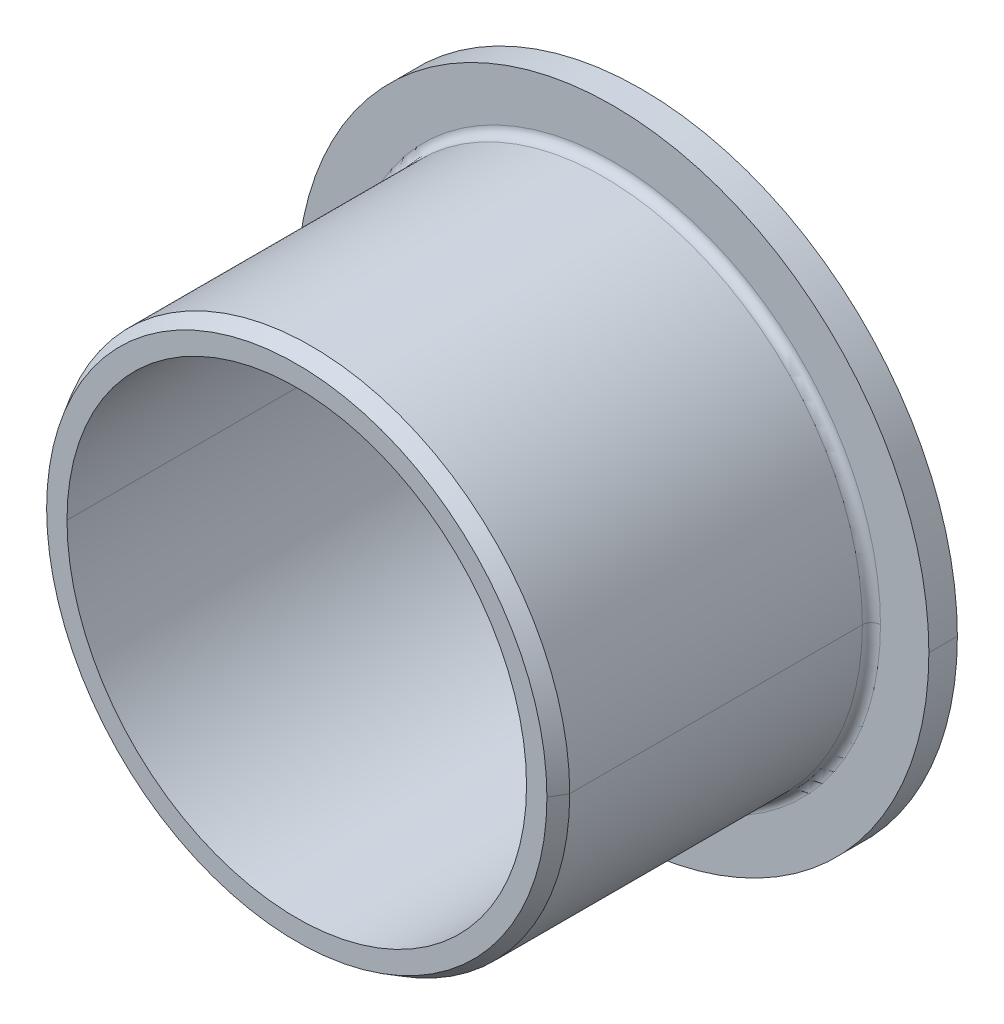
ISO-10303-21;
HEADER;
FILE_DESCRIPTION(('STEP AP214'),'2;1');
FILE_NAME('part.step','',(''),(''),'','','');
FILE_SCHEMA(('AUTOMOTIVE_DESIGN { 1 0 10303 214 1 1 1 1 }'));
ENDSEC;
DATA;
#1=APPLICATION_CONTEXT('core data for automotive mechanical design processes');
#2=APPLICATION_PROTOCOL_DEFINITION('international standard','automotive_design',2000,#1);
#3=PRODUCT_CONTEXT('',#1,'mechanical');
#4=PRODUCT('Part','Part','',(#3));
#5=PRODUCT_RELATED_PRODUCT_CATEGORY('part','',(#4));
#6=PRODUCT_DEFINITION_FORMATION('','',#4);
#7=PRODUCT_DEFINITION_CONTEXT('part definition',#1,'design');
#8=PRODUCT_DEFINITION('design','',#6,#7);
#9=PRODUCT_DEFINITION_SHAPE('','',#8);
#10=(LENGTH_UNIT() NAMED_UNIT(*) SI_UNIT(.MILLI.,.METRE.));
#11=(NAMED_UNIT(*) PLANE_ANGLE_UNIT() SI_UNIT($,.RADIAN.));
#12=(NAMED_UNIT(*) SI_UNIT($,.STERADIAN.) SOLID_ANGLE_UNIT());
#13=UNCERTAINTY_MEASURE_WITH_UNIT(LENGTH_MEASURE(1.E-05),#10,'distance_accuracy_value','');
#14=(GEOMETRIC_REPRESENTATION_CONTEXT(3) GLOBAL_UNCERTAINTY_ASSIGNED_CONTEXT((#13)) GLOBAL_UNIT_ASSIGNED_CONTEXT((#10,
#11,#12)) REPRESENTATION_CONTEXT('',''));
#15=CARTESIAN_POINT('',(0.,0.,0.));
#16=DIRECTION('',(0.,0.,1.));
#17=DIRECTION('',(1.,0.,0.));
#18=AXIS2_PLACEMENT_3D('',#15,#16,#17);
#19=CARTESIAN_POINT('',(15.08125,0.,0.));
#20=DIRECTION('',(0.,0.,-1.));
#21=DIRECTION('',(0.,-1.,0.));
#22=AXIS2_PLACEMENT_3D('',#19,#20,#21);
#23=PLANE('',#22);
#24=CARTESIAN_POINT('',(0.,0.,0.));
#25=DIRECTION('',(0.,0.,1.));
#26=DIRECTION('',(1.,0.,0.));
#27=AXIS2_PLACEMENT_3D('',#24,#25,#26);
#28=CIRCLE('',#27,12.7);
#29=CARTESIAN_POINT('',(12.7,0.,0.));
#30=VERTEX_POINT('',#29);
#31=CARTESIAN_POINT('',(-12.7,0.,0.));
#32=VERTEX_POINT('',#31);
#33=EDGE_CURVE('E10',#30,#32,#28,.T.);
#34=ORIENTED_EDGE('',*,*,#33,.T.);
#35=CARTESIAN_POINT('',(0.,0.,0.));
#36=DIRECTION('',(0.,0.,1.));
#37=DIRECTION('',(1.,0.,0.));
#38=AXIS2_PLACEMENT_3D('',#35,#36,#37);
#39=CIRCLE('',#38,12.7);
#40=EDGE_CURVE('E162',#32,#30,#39,.T.);
#41=ORIENTED_EDGE('',*,*,#40,.T.);
#42=EDGE_LOOP('',(#34,#41));
#43=FACE_BOUND('',#42,.T.);
#44=CARTESIAN_POINT('',(0.,0.,0.));
#45=DIRECTION('',(0.,0.,1.));
#46=DIRECTION('',(1.,0.,0.));
#47=AXIS2_PLACEMENT_3D('',#44,#45,#46);
#48=CIRCLE('',#47,17.4625);
#49=CARTESIAN_POINT('',(17.4625,0.,0.));
#50=VERTEX_POINT('',#49);
#51=CARTESIAN_POINT('',(-17.4625,0.,0.));
#52=VERTEX_POINT('',#51);
#53=EDGE_CURVE('E164',#50,#52,#48,.T.);
#54=ORIENTED_EDGE('',*,*,#53,.F.);
#55=CARTESIAN_POINT('',(0.,0.,0.));
#56=DIRECTION('',(0.,0.,1.));
#57=DIRECTION('',(1.,0.,0.));
#58=AXIS2_PLACEMENT_3D('',#55,#56,#57);
#59=CIRCLE('',#58,17.4625);
#60=EDGE_CURVE('E98',#52,#50,#59,.T.);
#61=ORIENTED_EDGE('',*,*,#60,.F.);
#62=EDGE_LOOP('',(#54,#61));
#63=FACE_BOUND('',#62,.T.);
#64=ADVANCED_FACE('F16',(#43,#63),#23,.T.);
#65=CARTESIAN_POINT('',(0.,0.,9.525));
#66=DIRECTION('',(0.,0.,1.));
#67=DIRECTION('',(1.,0.,0.));
#68=AXIS2_PLACEMENT_3D('',#65,#66,#67);
#69=CYLINDRICAL_SURFACE('',#68,12.7);
#70=DIRECTION('',(0.,0.,1.));
#71=VECTOR('',#70,1.);
#72=CARTESIAN_POINT('',(12.7,0.,9.525));
#73=LINE('',#72,#71);
#74=CARTESIAN_POINT('',(12.7,0.,19.05));
#75=VERTEX_POINT('',#74);
#76=EDGE_CURVE('E20',#30,#75,#73,.T.);
#77=ORIENTED_EDGE('',*,*,#76,.T.);
#78=CARTESIAN_POINT('',(0.,0.,19.05));
#79=DIRECTION('',(0.,0.,1.));
#80=DIRECTION('',(1.,0.,0.));
#81=AXIS2_PLACEMENT_3D('',#78,#79,#80);
#82=CIRCLE('',#81,12.7);
#83=CARTESIAN_POINT('',(-12.7,0.,19.05));
#84=VERTEX_POINT('',#83);
#85=EDGE_CURVE('E27',#75,#84,#82,.T.);
#86=ORIENTED_EDGE('',*,*,#85,.T.);
#87=DIRECTION('',(0.,0.,-1.));
#88=VECTOR('',#87,1.);
#89=CARTESIAN_POINT('',(-12.7,0.,9.525));
#90=LINE('',#89,#88);
#91=EDGE_CURVE('E192',#84,#32,#90,.T.);
#92=ORIENTED_EDGE('',*,*,#91,.T.);
#93=ORIENTED_EDGE('',*,*,#33,.F.);
#94=EDGE_LOOP('',(#77,#86,#92,#93));
#95=FACE_BOUND('',#94,.T.);
#96=ADVANCED_FACE('F18',(#95),#69,.F.);
#97=CARTESIAN_POINT('',(13.2628098923,0.,19.05));
#98=DIRECTION('',(0.,0.,1.));
#99=DIRECTION('',(1.,0.,0.));
#100=AXIS2_PLACEMENT_3D('',#97,#98,#99);
#101=PLANE('',#100);
#102=ORIENTED_EDGE('',*,*,#85,.F.);
#103=CARTESIAN_POINT('',(0.,0.,19.05));
#104=DIRECTION('',(0.,0.,1.));
#105=DIRECTION('',(1.,0.,0.));
#106=AXIS2_PLACEMENT_3D('',#103,#104,#105);
#107=CIRCLE('',#106,12.7);
#108=EDGE_CURVE('E189',#84,#75,#107,.T.);
#109=ORIENTED_EDGE('',*,*,#108,.F.);
#110=EDGE_LOOP('',(#102,#109));
#111=FACE_BOUND('',#110,.T.);
#112=CARTESIAN_POINT('',(0.,0.,19.05));
#113=DIRECTION('',(0.,0.,1.));
#114=DIRECTION('',(1.,0.,0.));
#115=AXIS2_PLACEMENT_3D('',#112,#113,#114);
#116=CIRCLE('',#115,13.8256197846);
#117=CARTESIAN_POINT('',(13.8256197846,0.,19.05));
#118=VERTEX_POINT('',#117);
#119=CARTESIAN_POINT('',(-13.8256197846,0.,19.05));
#120=VERTEX_POINT('',#119);
#121=EDGE_CURVE('E151',#118,#120,#116,.T.);
#122=ORIENTED_EDGE('',*,*,#121,.T.);
#123=CARTESIAN_POINT('',(0.,0.,19.05));
#124=DIRECTION('',(0.,0.,1.));
#125=DIRECTION('',(1.,0.,0.));
#126=AXIS2_PLACEMENT_3D('',#123,#124,#125);
#127=CIRCLE('',#126,13.8256197846);
#128=EDGE_CURVE('E178',#120,#118,#127,.T.);
#129=ORIENTED_EDGE('',*,*,#128,.T.);
#130=EDGE_LOOP('',(#122,#129));
#131=FACE_BOUND('',#130,.T.);
#132=ADVANCED_FACE('F218',(#111,#131),#101,.T.);
#133=CARTESIAN_POINT('',(0.,0.,18.65));
#134=DIRECTION('',(0.,0.,-1.));
#135=DIRECTION('',(1.,0.,0.));
#136=AXIS2_PLACEMENT_3D('',#133,#134,#135);
#137=CONICAL_SURFACE('',#136,14.0565598923,0.523598775643578);
#138=DIRECTION('',(-0.500000000039213,0.,0.866025403761799));
#139=VECTOR('',#138,1.);
#140=CARTESIAN_POINT('',(14.0565598923,0.,18.65));
#141=LINE('',#140,#139);
#142=CARTESIAN_POINT('',(14.2875,0.,18.25));
#143=VERTEX_POINT('',#142);
#144=EDGE_CURVE('E185',#143,#118,#141,.T.);
#145=ORIENTED_EDGE('',*,*,#144,.T.);
#146=ORIENTED_EDGE('',*,*,#128,.F.);
#147=DIRECTION('',(-0.500000000039213,0.,-0.866025403761799));
#148=VECTOR('',#147,1.);
#149=CARTESIAN_POINT('',(-14.0565598923,0.,18.65));
#150=LINE('',#149,#148);
#151=CARTESIAN_POINT('',(-14.2875,0.,18.25));
#152=VERTEX_POINT('',#151);
#153=EDGE_CURVE('E158',#120,#152,#150,.T.);
#154=ORIENTED_EDGE('',*,*,#153,.T.);
#155=CARTESIAN_POINT('',(0.,0.,18.25));
#156=DIRECTION('',(0.,0.,1.));
#157=DIRECTION('',(1.,0.,0.));
#158=AXIS2_PLACEMENT_3D('',#155,#156,#157);
#159=CIRCLE('',#158,14.2875);
#160=EDGE_CURVE('E171',#152,#143,#159,.T.);
#161=ORIENTED_EDGE('',*,*,#160,.T.);
#162=EDGE_LOOP('',(#145,#146,#154,#161));
#163=FACE_BOUND('',#162,.T.);
#164=ADVANCED_FACE('F212',(#163),#137,.T.);
#165=CARTESIAN_POINT('',(0.,0.,10.1624));
#166=DIRECTION('',(0.,0.,1.));
#167=DIRECTION('',(1.,0.,0.));
#168=AXIS2_PLACEMENT_3D('',#165,#166,#167);
#169=CYLINDRICAL_SURFACE('',#168,14.2875);
#170=DIRECTION('',(0.,0.,1.));
#171=VECTOR('',#170,1.);
#172=CARTESIAN_POINT('',(14.2875,0.,10.1624));
#173=LINE('',#172,#171);
#174=CARTESIAN_POINT('',(14.2875,0.,2.0748));
#175=VERTEX_POINT('',#174);
#176=EDGE_CURVE('E121',#175,#143,#173,.T.);
#177=ORIENTED_EDGE('',*,*,#176,.T.);
#178=ORIENTED_EDGE('',*,*,#160,.F.);
#179=DIRECTION('',(0.,0.,-1.));
#180=VECTOR('',#179,1.);
#181=CARTESIAN_POINT('',(-14.2875,0.,10.1624));
#182=LINE('',#181,#180);
#183=CARTESIAN_POINT('',(-14.2875,0.,2.0748));
#184=VERTEX_POINT('',#183);
#185=EDGE_CURVE('E124',#152,#184,#182,.T.);
#186=ORIENTED_EDGE('',*,*,#185,.T.);
#187=CARTESIAN_POINT('',(0.,0.,2.0748));
#188=DIRECTION('',(0.,0.,1.));
#189=DIRECTION('',(1.,0.,0.));
#190=AXIS2_PLACEMENT_3D('',#187,#188,#189);
#191=CIRCLE('',#190,14.2875);
#192=EDGE_CURVE('E117',#184,#175,#191,.T.);
#193=ORIENTED_EDGE('',*,*,#192,.T.);
#194=EDGE_LOOP('',(#177,#178,#186,#193));
#195=FACE_BOUND('',#194,.T.);
#196=ADVANCED_FACE('F119',(#195),#169,.T.);
#197=CARTESIAN_POINT('',(0.,0.,2.0748));
#198=DIRECTION('',(0.,0.,1.));
#199=DIRECTION('',(1.,0.,0.));
#200=AXIS2_PLACEMENT_3D('',#197,#198,#199);
#201=TOROIDAL_SURFACE('',#200,14.7875,0.5);
#202=CARTESIAN_POINT('',(-14.7875,0.,2.0748));
#203=DIRECTION('',(0.,-1.,0.));
#204=DIRECTION('',(-1.,0.,0.));
#205=AXIS2_PLACEMENT_3D('',#202,#203,#204);
#206=CIRCLE('',#205,0.5);
#207=CARTESIAN_POINT('',(-14.7875,0.,1.5748));
#208=VERTEX_POINT('',#207);
#209=EDGE_CURVE('E142',#208,#184,#206,.T.);
#210=ORIENTED_EDGE('',*,*,#209,.T.);
#211=CARTESIAN_POINT('',(0.,0.,2.0748));
#212=DIRECTION('',(0.,0.,1.));
#213=DIRECTION('',(1.,0.,0.));
#214=AXIS2_PLACEMENT_3D('',#211,#212,#213);
#215=CIRCLE('',#214,14.2875);
#216=EDGE_CURVE('E140',#175,#184,#215,.T.);
#217=ORIENTED_EDGE('',*,*,#216,.F.);
#218=CARTESIAN_POINT('',(14.7875,0.,2.0748));
#219=DIRECTION('',(0.,-1.,0.));
#220=DIRECTION('',(1.,0.,0.));
#221=AXIS2_PLACEMENT_3D('',#218,#219,#220);
#222=CIRCLE('',#221,0.5);
#223=CARTESIAN_POINT('',(14.7875,0.,1.5748));
#224=VERTEX_POINT('',#223);
#225=EDGE_CURVE('E131',#175,#224,#222,.T.);
#226=ORIENTED_EDGE('',*,*,#225,.T.);
#227=CARTESIAN_POINT('',(0.,0.,1.5748));
#228=DIRECTION('',(0.,0.,1.));
#229=DIRECTION('',(1.,0.,0.));
#230=AXIS2_PLACEMENT_3D('',#227,#228,#229);
#231=CIRCLE('',#230,14.7875);
#232=EDGE_CURVE('E109',#224,#208,#231,.T.);
#233=ORIENTED_EDGE('',*,*,#232,.T.);
#234=EDGE_LOOP('',(#210,#217,#226,#233));
#235=FACE_BOUND('',#234,.T.);
#236=ADVANCED_FACE('F141',(#235),#201,.F.);
#237=CARTESIAN_POINT('',(16.125,0.,1.5748));
#238=DIRECTION('',(0.,0.,1.));
#239=DIRECTION('',(1.,0.,0.));
#240=AXIS2_PLACEMENT_3D('',#237,#238,#239);
#241=PLANE('',#240);
#242=ORIENTED_EDGE('',*,*,#232,.F.);
#243=CARTESIAN_POINT('',(0.,0.,1.5748));
#244=DIRECTION('',(0.,0.,1.));
#245=DIRECTION('',(1.,0.,0.));
#246=AXIS2_PLACEMENT_3D('',#243,#244,#245);
#247=CIRCLE('',#246,14.7875);
#248=EDGE_CURVE('E136',#208,#224,#247,.T.);
#249=ORIENTED_EDGE('',*,*,#248,.F.);
#250=EDGE_LOOP('',(#242,#249));
#251=FACE_BOUND('',#250,.T.);
#252=CARTESIAN_POINT('',(0.,0.,1.5748));
#253=DIRECTION('',(0.,0.,1.));
#254=DIRECTION('',(1.,0.,0.));
#255=AXIS2_PLACEMENT_3D('',#252,#253,#254);
#256=CIRCLE('',#255,17.4625);
#257=CARTESIAN_POINT('',(17.4625,0.,1.5748));
#258=VERTEX_POINT('',#257);
#259=CARTESIAN_POINT('',(-17.4625,0.,1.5748));
#260=VERTEX_POINT('',#259);
#261=EDGE_CURVE('E173',#258,#260,#256,.T.);
#262=ORIENTED_EDGE('',*,*,#261,.T.);
#263=CARTESIAN_POINT('',(0.,0.,1.5748));
#264=DIRECTION('',(0.,0.,1.));
#265=DIRECTION('',(1.,0.,0.));
#266=AXIS2_PLACEMENT_3D('',#263,#264,#265);
#267=CIRCLE('',#266,17.4625);
#268=EDGE_CURVE('E41',#260,#258,#267,.T.);
#269=ORIENTED_EDGE('',*,*,#268,.T.);
#270=EDGE_LOOP('',(#262,#269));
#271=FACE_BOUND('',#270,.T.);
#272=ADVANCED_FACE('F250',(#251,#271),#241,.T.);
#273=CARTESIAN_POINT('',(0.,0.,0.7874));
#274=DIRECTION('',(0.,0.,1.));
#275=DIRECTION('',(1.,0.,0.));
#276=AXIS2_PLACEMENT_3D('',#273,#274,#275);
#277=CYLINDRICAL_SURFACE('',#276,17.4625);
#278=DIRECTION('',(0.,0.,1.));
#279=VECTOR('',#278,1.);
#280=CARTESIAN_POINT('',(17.4625,0.,0.7874));
#281=LINE('',#280,#279);
#282=EDGE_CURVE('E130',#50,#258,#281,.T.);
#283=ORIENTED_EDGE('',*,*,#282,.T.);
#284=ORIENTED_EDGE('',*,*,#268,.F.);
#285=DIRECTION('',(0.,0.,-1.));
#286=VECTOR('',#285,1.);
#287=CARTESIAN_POINT('',(-17.4625,0.,0.7874));
#288=LINE('',#287,#286);
#289=EDGE_CURVE('E168',#260,#52,#288,.T.);
#290=ORIENTED_EDGE('',*,*,#289,.T.);
#291=ORIENTED_EDGE('',*,*,#60,.T.);
#292=EDGE_LOOP('',(#283,#284,#290,#291));
#293=FACE_BOUND('',#292,.T.);
#294=ADVANCED_FACE('F245',(#293),#277,.T.);
#295=CARTESIAN_POINT('',(0.,0.,0.7874));
#296=DIRECTION('',(0.,0.,1.));
#297=DIRECTION('',(1.,0.,0.));
#298=AXIS2_PLACEMENT_3D('',#295,#296,#297);
#299=CYLINDRICAL_SURFACE('',#298,17.4625);
#300=ORIENTED_EDGE('',*,*,#282,.F.);
#301=ORIENTED_EDGE('',*,*,#53,.T.);
#302=ORIENTED_EDGE('',*,*,#289,.F.);
#303=ORIENTED_EDGE('',*,*,#261,.F.);
#304=EDGE_LOOP('',(#300,#301,#302,#303));
#305=FACE_BOUND('',#304,.T.);
#306=ADVANCED_FACE('F233',(#305),#299,.T.);
#307=CARTESIAN_POINT('',(0.,0.,2.0748));
#308=DIRECTION('',(0.,0.,1.));
#309=DIRECTION('',(1.,0.,0.));
#310=AXIS2_PLACEMENT_3D('',#307,#308,#309);
#311=TOROIDAL_SURFACE('',#310,14.7875,0.5);
#312=ORIENTED_EDGE('',*,*,#209,.F.);
#313=ORIENTED_EDGE('',*,*,#248,.T.);
#314=ORIENTED_EDGE('',*,*,#225,.F.);
#315=ORIENTED_EDGE('',*,*,#192,.F.);
#316=EDGE_LOOP('',(#312,#313,#314,#315));
#317=FACE_BOUND('',#316,.T.);
#318=ADVANCED_FACE('F135',(#317),#311,.F.);
#319=CARTESIAN_POINT('',(0.,0.,10.1624));
#320=DIRECTION('',(0.,0.,1.));
#321=DIRECTION('',(1.,0.,0.));
#322=AXIS2_PLACEMENT_3D('',#319,#320,#321);
#323=CYLINDRICAL_SURFACE('',#322,14.2875);
#324=ORIENTED_EDGE('',*,*,#176,.F.);
#325=ORIENTED_EDGE('',*,*,#216,.T.);
#326=ORIENTED_EDGE('',*,*,#185,.F.);
#327=CARTESIAN_POINT('',(0.,0.,18.25));
#328=DIRECTION('',(0.,0.,1.));
#329=DIRECTION('',(1.,0.,0.));
#330=AXIS2_PLACEMENT_3D('',#327,#328,#329);
#331=CIRCLE('',#330,14.2875);
#332=EDGE_CURVE('E148',#143,#152,#331,.T.);
#333=ORIENTED_EDGE('',*,*,#332,.F.);
#334=EDGE_LOOP('',(#324,#325,#326,#333));
#335=FACE_BOUND('',#334,.T.);
#336=ADVANCED_FACE('F146',(#335),#323,.T.);
#337=CARTESIAN_POINT('',(0.,0.,18.65));
#338=DIRECTION('',(0.,0.,-1.));
#339=DIRECTION('',(1.,0.,0.));
#340=AXIS2_PLACEMENT_3D('',#337,#338,#339);
#341=CONICAL_SURFACE('',#340,14.0565598923,0.523598775643578);
#342=ORIENTED_EDGE('',*,*,#144,.F.);
#343=ORIENTED_EDGE('',*,*,#332,.T.);
#344=ORIENTED_EDGE('',*,*,#153,.F.);
#345=ORIENTED_EDGE('',*,*,#121,.F.);
#346=EDGE_LOOP('',(#342,#343,#344,#345));
#347=FACE_BOUND('',#346,.T.);
#348=ADVANCED_FACE('F215',(#347),#341,.T.);
#349=CARTESIAN_POINT('',(0.,0.,9.525));
#350=DIRECTION('',(0.,0.,1.));
#351=DIRECTION('',(1.,0.,0.));
#352=AXIS2_PLACEMENT_3D('',#349,#350,#351);
#353=CYLINDRICAL_SURFACE('',#352,12.7);
#354=ORIENTED_EDGE('',*,*,#76,.F.);
#355=ORIENTED_EDGE('',*,*,#40,.F.);
#356=ORIENTED_EDGE('',*,*,#91,.F.);
#357=ORIENTED_EDGE('',*,*,#108,.T.);
#358=EDGE_LOOP('',(#354,#355,#356,#357));
#359=FACE_BOUND('',#358,.T.);
#360=ADVANCED_FACE('F235',(#359),#353,.F.);
#361=CLOSED_SHELL('',(#64,#96,#132,#164,#196,#236,#272,#294,#306,#318,#336,#348,#360));
#362=MANIFOLD_SOLID_BREP('B1',#361);
#363=ADVANCED_BREP_SHAPE_REPRESENTATION('',(#18,#362),#14);
#364=SHAPE_DEFINITION_REPRESENTATION(#9,#363);
ENDSEC;
END-ISO-10303-21;
